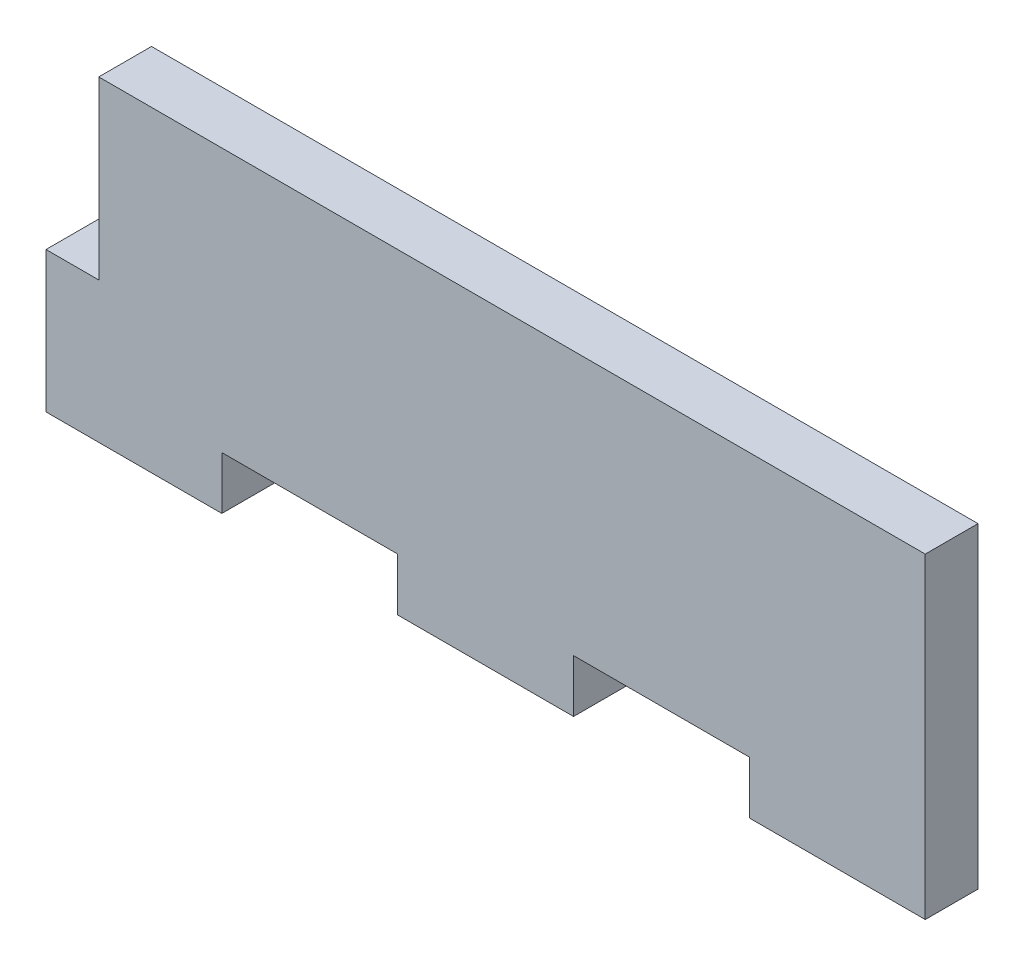
ISO-10303-21;
HEADER;
FILE_DESCRIPTION(('STEP AP214'),'2;1');
FILE_NAME('part.step','',(''),(''),'','','');
FILE_SCHEMA(('AUTOMOTIVE_DESIGN { 1 0 10303 214 1 1 1 1 }'));
ENDSEC;
DATA;
#1=APPLICATION_CONTEXT('core data for automotive mechanical design processes');
#2=APPLICATION_PROTOCOL_DEFINITION('international standard','automotive_design',2000,#1);
#3=PRODUCT_CONTEXT('',#1,'mechanical');
#4=PRODUCT('Part','Part','',(#3));
#5=PRODUCT_RELATED_PRODUCT_CATEGORY('part','',(#4));
#6=PRODUCT_DEFINITION_FORMATION('','',#4);
#7=PRODUCT_DEFINITION_CONTEXT('part definition',#1,'design');
#8=PRODUCT_DEFINITION('design','',#6,#7);
#9=PRODUCT_DEFINITION_SHAPE('','',#8);
#10=(LENGTH_UNIT() NAMED_UNIT(*) SI_UNIT(.MILLI.,.METRE.));
#11=(NAMED_UNIT(*) PLANE_ANGLE_UNIT() SI_UNIT($,.RADIAN.));
#12=(NAMED_UNIT(*) SI_UNIT($,.STERADIAN.) SOLID_ANGLE_UNIT());
#13=UNCERTAINTY_MEASURE_WITH_UNIT(LENGTH_MEASURE(1.E-05),#10,'distance_accuracy_value','');
#14=(GEOMETRIC_REPRESENTATION_CONTEXT(3) GLOBAL_UNCERTAINTY_ASSIGNED_CONTEXT((#13)) GLOBAL_UNIT_ASSIGNED_CONTEXT((#10,
#11,#12)) REPRESENTATION_CONTEXT('',''));
#15=CARTESIAN_POINT('',(0.,0.,0.));
#16=DIRECTION('',(0.,0.,1.));
#17=DIRECTION('',(1.,0.,0.));
#18=AXIS2_PLACEMENT_3D('',#15,#16,#17);
#19=CARTESIAN_POINT('',(0.,-18.,3.));
#20=DIRECTION('',(0.,1.,0.));
#21=DIRECTION('',(0.,0.,1.));
#22=AXIS2_PLACEMENT_3D('',#19,#20,#21);
#23=PLANE('',#22);
#24=DIRECTION('',(1.,0.,0.));
#25=VECTOR('',#24,1.);
#26=CARTESIAN_POINT('',(0.,-18.,3.));
#27=LINE('',#26,#25);
#28=CARTESIAN_POINT('',(20.,-18.,3.));
#29=VERTEX_POINT('',#28);
#30=CARTESIAN_POINT('',(30.,-18.,3.));
#31=VERTEX_POINT('',#30);
#32=EDGE_CURVE('E195',#29,#31,#27,.T.);
#33=ORIENTED_EDGE('',*,*,#32,.F.);
#34=DIRECTION('',(0.,0.,1.));
#35=VECTOR('',#34,1.);
#36=CARTESIAN_POINT('',(20.,-18.,0.));
#37=LINE('',#36,#35);
#38=CARTESIAN_POINT('',(20.,-18.,0.));
#39=VERTEX_POINT('',#38);
#40=EDGE_CURVE('E217',#39,#29,#37,.T.);
#41=ORIENTED_EDGE('',*,*,#40,.F.);
#42=DIRECTION('',(1.,0.,0.));
#43=VECTOR('',#42,1.);
#44=CARTESIAN_POINT('',(0.,-18.,0.));
#45=LINE('',#44,#43);
#46=CARTESIAN_POINT('',(30.,-18.,0.));
#47=VERTEX_POINT('',#46);
#48=EDGE_CURVE('E157',#39,#47,#45,.T.);
#49=ORIENTED_EDGE('',*,*,#48,.T.);
#50=DIRECTION('',(0.,0.,1.));
#51=VECTOR('',#50,1.);
#52=CARTESIAN_POINT('',(30.,-18.,0.));
#53=LINE('',#52,#51);
#54=EDGE_CURVE('E159',#47,#31,#53,.T.);
#55=ORIENTED_EDGE('',*,*,#54,.T.);
#56=EDGE_LOOP('',(#33,#41,#49,#55));
#57=FACE_BOUND('',#56,.T.);
#58=ADVANCED_FACE('F33',(#57),#23,.F.);
#59=CARTESIAN_POINT('',(40.,-18.,3.));
#60=VERTEX_POINT('',#59);
#61=CARTESIAN_POINT('',(50.,-18.,3.));
#62=VERTEX_POINT('',#61);
#63=EDGE_CURVE('E197',#60,#62,#27,.T.);
#64=ORIENTED_EDGE('',*,*,#63,.F.);
#65=DIRECTION('',(0.,0.,1.));
#66=VECTOR('',#65,1.);
#67=CARTESIAN_POINT('',(40.,-18.,0.));
#68=LINE('',#67,#66);
#69=CARTESIAN_POINT('',(40.,-18.,0.));
#70=VERTEX_POINT('',#69);
#71=EDGE_CURVE('E155',#70,#60,#68,.T.);
#72=ORIENTED_EDGE('',*,*,#71,.F.);
#73=CARTESIAN_POINT('',(50.,-18.,0.));
#74=VERTEX_POINT('',#73);
#75=EDGE_CURVE('E154',#70,#74,#45,.T.);
#76=ORIENTED_EDGE('',*,*,#75,.T.);
#77=DIRECTION('',(0.,0.,-1.));
#78=VECTOR('',#77,1.);
#79=CARTESIAN_POINT('',(50.,-18.,3.));
#80=LINE('',#79,#78);
#81=EDGE_CURVE('E41',#62,#74,#80,.T.);
#82=ORIENTED_EDGE('',*,*,#81,.F.);
#83=EDGE_LOOP('',(#64,#72,#76,#82));
#84=FACE_BOUND('',#83,.T.);
#85=ADVANCED_FACE('F266',(#84),#23,.F.);
#86=CARTESIAN_POINT('',(0.,0.,3.));
#87=DIRECTION('',(1.,0.,0.));
#88=DIRECTION('',(0.,1.,0.));
#89=AXIS2_PLACEMENT_3D('',#86,#87,#88);
#90=PLANE('',#89);
#91=DIRECTION('',(0.,-1.,0.));
#92=VECTOR('',#91,1.);
#93=CARTESIAN_POINT('',(0.,0.,3.));
#94=LINE('',#93,#92);
#95=CARTESIAN_POINT('',(0.,-10.,3.));
#96=VERTEX_POINT('',#95);
#97=CARTESIAN_POINT('',(0.,-18.,3.));
#98=VERTEX_POINT('',#97);
#99=EDGE_CURVE('E149',#96,#98,#94,.T.);
#100=ORIENTED_EDGE('',*,*,#99,.F.);
#101=DIRECTION('',(0.,0.,1.));
#102=VECTOR('',#101,1.);
#103=CARTESIAN_POINT('',(0.,-10.,0.));
#104=LINE('',#103,#102);
#105=CARTESIAN_POINT('',(0.,-10.,0.));
#106=VERTEX_POINT('',#105);
#107=EDGE_CURVE('E137',#106,#96,#104,.T.);
#108=ORIENTED_EDGE('',*,*,#107,.F.);
#109=DIRECTION('',(0.,-1.,0.));
#110=VECTOR('',#109,1.);
#111=CARTESIAN_POINT('',(0.,0.,0.));
#112=LINE('',#111,#110);
#113=CARTESIAN_POINT('',(0.,-18.,0.));
#114=VERTEX_POINT('',#113);
#115=EDGE_CURVE('E147',#106,#114,#112,.T.);
#116=ORIENTED_EDGE('',*,*,#115,.T.);
#117=DIRECTION('',(0.,0.,-1.));
#118=VECTOR('',#117,1.);
#119=CARTESIAN_POINT('',(0.,-18.,3.));
#120=LINE('',#119,#118);
#121=EDGE_CURVE('E11',#98,#114,#120,.T.);
#122=ORIENTED_EDGE('',*,*,#121,.F.);
#123=EDGE_LOOP('',(#100,#108,#116,#122));
#124=FACE_BOUND('',#123,.T.);
#125=ADVANCED_FACE('F35',(#124),#90,.F.);
#126=CARTESIAN_POINT('',(10.,-18.,0.));
#127=VERTEX_POINT('',#126);
#128=EDGE_CURVE('E153',#114,#127,#45,.T.);
#129=ORIENTED_EDGE('',*,*,#128,.T.);
#130=DIRECTION('',(0.,0.,1.));
#131=VECTOR('',#130,1.);
#132=CARTESIAN_POINT('',(10.,-18.,0.));
#133=LINE('',#132,#131);
#134=CARTESIAN_POINT('',(10.,-18.,3.));
#135=VERTEX_POINT('',#134);
#136=EDGE_CURVE('E228',#127,#135,#133,.T.);
#137=ORIENTED_EDGE('',*,*,#136,.T.);
#138=EDGE_CURVE('E193',#98,#135,#27,.T.);
#139=ORIENTED_EDGE('',*,*,#138,.F.);
#140=ORIENTED_EDGE('',*,*,#121,.T.);
#141=EDGE_LOOP('',(#129,#137,#139,#140));
#142=FACE_BOUND('',#141,.T.);
#143=ADVANCED_FACE('F268',(#142),#23,.F.);
#144=CARTESIAN_POINT('',(50.,0.,3.));
#145=DIRECTION('',(-1.,0.,0.));
#146=DIRECTION('',(0.,-1.,0.));
#147=AXIS2_PLACEMENT_3D('',#144,#145,#146);
#148=PLANE('',#147);
#149=DIRECTION('',(0.,1.,0.));
#150=VECTOR('',#149,1.);
#151=CARTESIAN_POINT('',(50.,0.,0.));
#152=LINE('',#151,#150);
#153=CARTESIAN_POINT('',(50.,0.,0.));
#154=VERTEX_POINT('',#153);
#155=EDGE_CURVE('E165',#74,#154,#152,.T.);
#156=ORIENTED_EDGE('',*,*,#155,.T.);
#157=DIRECTION('',(0.,0.,-1.));
#158=VECTOR('',#157,1.);
#159=CARTESIAN_POINT('',(50.,0.,3.));
#160=LINE('',#159,#158);
#161=CARTESIAN_POINT('',(50.,0.,3.));
#162=VERTEX_POINT('',#161);
#163=EDGE_CURVE('E170',#162,#154,#160,.T.);
#164=ORIENTED_EDGE('',*,*,#163,.F.);
#165=DIRECTION('',(0.,1.,0.));
#166=VECTOR('',#165,1.);
#167=CARTESIAN_POINT('',(50.,0.,3.));
#168=LINE('',#167,#166);
#169=EDGE_CURVE('E179',#62,#162,#168,.T.);
#170=ORIENTED_EDGE('',*,*,#169,.F.);
#171=ORIENTED_EDGE('',*,*,#81,.T.);
#172=EDGE_LOOP('',(#156,#164,#170,#171));
#173=FACE_BOUND('',#172,.T.);
#174=ADVANCED_FACE('F177',(#173),#148,.F.);
#175=CARTESIAN_POINT('',(0.,0.,3.));
#176=DIRECTION('',(0.,-1.,0.));
#177=DIRECTION('',(0.,0.,-1.));
#178=AXIS2_PLACEMENT_3D('',#175,#176,#177);
#179=PLANE('',#178);
#180=DIRECTION('',(-1.,0.,0.));
#181=VECTOR('',#180,1.);
#182=CARTESIAN_POINT('',(0.,0.,0.));
#183=LINE('',#182,#181);
#184=CARTESIAN_POINT('',(3.,0.,0.));
#185=VERTEX_POINT('',#184);
#186=EDGE_CURVE('E167',#154,#185,#183,.T.);
#187=ORIENTED_EDGE('',*,*,#186,.T.);
#188=DIRECTION('',(0.,0.,1.));
#189=VECTOR('',#188,1.);
#190=CARTESIAN_POINT('',(3.,0.,0.));
#191=LINE('',#190,#189);
#192=CARTESIAN_POINT('',(3.,0.,3.));
#193=VERTEX_POINT('',#192);
#194=EDGE_CURVE('E189',#185,#193,#191,.T.);
#195=ORIENTED_EDGE('',*,*,#194,.T.);
#196=DIRECTION('',(-1.,0.,0.));
#197=VECTOR('',#196,1.);
#198=CARTESIAN_POINT('',(0.,0.,3.));
#199=LINE('',#198,#197);
#200=EDGE_CURVE('E162',#162,#193,#199,.T.);
#201=ORIENTED_EDGE('',*,*,#200,.F.);
#202=ORIENTED_EDGE('',*,*,#163,.T.);
#203=EDGE_LOOP('',(#187,#195,#201,#202));
#204=FACE_BOUND('',#203,.T.);
#205=ADVANCED_FACE('F187',(#204),#179,.F.);
#206=CARTESIAN_POINT('',(0.,0.,3.));
#207=DIRECTION('',(0.,0.,1.));
#208=DIRECTION('',(1.,0.,0.));
#209=AXIS2_PLACEMENT_3D('',#206,#207,#208);
#210=PLANE('',#209);
#211=DIRECTION('',(0.,1.,0.));
#212=VECTOR('',#211,1.);
#213=CARTESIAN_POINT('',(3.,0.,3.));
#214=LINE('',#213,#212);
#215=CARTESIAN_POINT('',(3.,-10.,3.));
#216=VERTEX_POINT('',#215);
#217=EDGE_CURVE('E142',#216,#193,#214,.T.);
#218=ORIENTED_EDGE('',*,*,#217,.F.);
#219=DIRECTION('',(1.,0.,0.));
#220=VECTOR('',#219,1.);
#221=CARTESIAN_POINT('',(0.,-10.,3.));
#222=LINE('',#221,#220);
#223=EDGE_CURVE('E250',#96,#216,#222,.T.);
#224=ORIENTED_EDGE('',*,*,#223,.F.);
#225=ORIENTED_EDGE('',*,*,#99,.T.);
#226=ORIENTED_EDGE('',*,*,#138,.T.);
#227=DIRECTION('',(0.,-1.,0.));
#228=VECTOR('',#227,1.);
#229=CARTESIAN_POINT('',(10.,-18.,3.));
#230=LINE('',#229,#228);
#231=CARTESIAN_POINT('',(10.,-15.,3.));
#232=VERTEX_POINT('',#231);
#233=EDGE_CURVE('E232',#232,#135,#230,.T.);
#234=ORIENTED_EDGE('',*,*,#233,.F.);
#235=DIRECTION('',(-1.,0.,0.));
#236=VECTOR('',#235,1.);
#237=CARTESIAN_POINT('',(20.,-15.,3.));
#238=LINE('',#237,#236);
#239=CARTESIAN_POINT('',(20.,-15.,3.));
#240=VERTEX_POINT('',#239);
#241=EDGE_CURVE('E235',#240,#232,#238,.T.);
#242=ORIENTED_EDGE('',*,*,#241,.F.);
#243=DIRECTION('',(0.,1.,0.));
#244=VECTOR('',#243,1.);
#245=CARTESIAN_POINT('',(20.,-18.,3.));
#246=LINE('',#245,#244);
#247=EDGE_CURVE('E238',#29,#240,#246,.T.);
#248=ORIENTED_EDGE('',*,*,#247,.F.);
#249=ORIENTED_EDGE('',*,*,#32,.T.);
#250=DIRECTION('',(0.,-1.,0.));
#251=VECTOR('',#250,1.);
#252=CARTESIAN_POINT('',(30.,-18.,3.));
#253=LINE('',#252,#251);
#254=CARTESIAN_POINT('',(30.,-15.,3.));
#255=VERTEX_POINT('',#254);
#256=EDGE_CURVE('E207',#255,#31,#253,.T.);
#257=ORIENTED_EDGE('',*,*,#256,.F.);
#258=DIRECTION('',(-1.,0.,0.));
#259=VECTOR('',#258,1.);
#260=CARTESIAN_POINT('',(40.,-15.,3.));
#261=LINE('',#260,#259);
#262=CARTESIAN_POINT('',(40.,-15.,3.));
#263=VERTEX_POINT('',#262);
#264=EDGE_CURVE('E211',#263,#255,#261,.T.);
#265=ORIENTED_EDGE('',*,*,#264,.F.);
#266=DIRECTION('',(0.,1.,0.));
#267=VECTOR('',#266,1.);
#268=CARTESIAN_POINT('',(40.,-18.,3.));
#269=LINE('',#268,#267);
#270=EDGE_CURVE('E214',#60,#263,#269,.T.);
#271=ORIENTED_EDGE('',*,*,#270,.F.);
#272=ORIENTED_EDGE('',*,*,#63,.T.);
#273=ORIENTED_EDGE('',*,*,#169,.T.);
#274=ORIENTED_EDGE('',*,*,#200,.T.);
#275=EDGE_LOOP('',(#218,#224,#225,#226,#234,#242,#248,#249,#257,#265,#271,#272,#273,#274));
#276=FACE_BOUND('',#275,.T.);
#277=ADVANCED_FACE('F252',(#276),#210,.T.);
#278=CARTESIAN_POINT('',(0.,0.,0.));
#279=DIRECTION('',(0.,0.,1.));
#280=DIRECTION('',(1.,0.,0.));
#281=AXIS2_PLACEMENT_3D('',#278,#279,#280);
#282=PLANE('',#281);
#283=DIRECTION('',(1.,0.,0.));
#284=VECTOR('',#283,1.);
#285=CARTESIAN_POINT('',(0.,-10.,0.));
#286=LINE('',#285,#284);
#287=CARTESIAN_POINT('',(3.,-10.,0.));
#288=VERTEX_POINT('',#287);
#289=EDGE_CURVE('E133',#106,#288,#286,.T.);
#290=ORIENTED_EDGE('',*,*,#289,.T.);
#291=DIRECTION('',(0.,1.,0.));
#292=VECTOR('',#291,1.);
#293=CARTESIAN_POINT('',(3.,0.,0.));
#294=LINE('',#293,#292);
#295=EDGE_CURVE('E48',#288,#185,#294,.T.);
#296=ORIENTED_EDGE('',*,*,#295,.T.);
#297=ORIENTED_EDGE('',*,*,#186,.F.);
#298=ORIENTED_EDGE('',*,*,#155,.F.);
#299=ORIENTED_EDGE('',*,*,#75,.F.);
#300=DIRECTION('',(0.,1.,0.));
#301=VECTOR('',#300,1.);
#302=CARTESIAN_POINT('',(40.,-18.,0.));
#303=LINE('',#302,#301);
#304=CARTESIAN_POINT('',(40.,-15.,0.));
#305=VERTEX_POINT('',#304);
#306=EDGE_CURVE('E210',#70,#305,#303,.T.);
#307=ORIENTED_EDGE('',*,*,#306,.T.);
#308=DIRECTION('',(-1.,0.,0.));
#309=VECTOR('',#308,1.);
#310=CARTESIAN_POINT('',(40.,-15.,0.));
#311=LINE('',#310,#309);
#312=CARTESIAN_POINT('',(30.,-15.,0.));
#313=VERTEX_POINT('',#312);
#314=EDGE_CURVE('E220',#305,#313,#311,.T.);
#315=ORIENTED_EDGE('',*,*,#314,.T.);
#316=DIRECTION('',(0.,-1.,0.));
#317=VECTOR('',#316,1.);
#318=CARTESIAN_POINT('',(30.,-18.,0.));
#319=LINE('',#318,#317);
#320=EDGE_CURVE('E203',#313,#47,#319,.T.);
#321=ORIENTED_EDGE('',*,*,#320,.T.);
#322=ORIENTED_EDGE('',*,*,#48,.F.);
#323=DIRECTION('',(0.,1.,0.));
#324=VECTOR('',#323,1.);
#325=CARTESIAN_POINT('',(20.,-18.,0.));
#326=LINE('',#325,#324);
#327=CARTESIAN_POINT('',(20.,-15.,0.));
#328=VERTEX_POINT('',#327);
#329=EDGE_CURVE('E234',#39,#328,#326,.T.);
#330=ORIENTED_EDGE('',*,*,#329,.T.);
#331=DIRECTION('',(-1.,0.,0.));
#332=VECTOR('',#331,1.);
#333=CARTESIAN_POINT('',(20.,-15.,0.));
#334=LINE('',#333,#332);
#335=CARTESIAN_POINT('',(10.,-15.,0.));
#336=VERTEX_POINT('',#335);
#337=EDGE_CURVE('E242',#328,#336,#334,.T.);
#338=ORIENTED_EDGE('',*,*,#337,.T.);
#339=DIRECTION('',(0.,-1.,0.));
#340=VECTOR('',#339,1.);
#341=CARTESIAN_POINT('',(10.,-18.,0.));
#342=LINE('',#341,#340);
#343=EDGE_CURVE('E56',#336,#127,#342,.T.);
#344=ORIENTED_EDGE('',*,*,#343,.T.);
#345=ORIENTED_EDGE('',*,*,#128,.F.);
#346=ORIENTED_EDGE('',*,*,#115,.F.);
#347=EDGE_LOOP('',(#290,#296,#297,#298,#299,#307,#315,#321,#322,#330,#338,#344,#345,#346));
#348=FACE_BOUND('',#347,.T.);
#349=ADVANCED_FACE('F151',(#348),#282,.F.);
#350=CARTESIAN_POINT('',(40.,-18.,0.));
#351=DIRECTION('',(1.,0.,0.));
#352=DIRECTION('',(0.,0.,-1.));
#353=AXIS2_PLACEMENT_3D('',#350,#351,#352);
#354=PLANE('',#353);
#355=ORIENTED_EDGE('',*,*,#270,.T.);
#356=DIRECTION('',(0.,0.,1.));
#357=VECTOR('',#356,1.);
#358=CARTESIAN_POINT('',(40.,-15.,0.));
#359=LINE('',#358,#357);
#360=EDGE_CURVE('E200',#305,#263,#359,.T.);
#361=ORIENTED_EDGE('',*,*,#360,.F.);
#362=ORIENTED_EDGE('',*,*,#306,.F.);
#363=ORIENTED_EDGE('',*,*,#71,.T.);
#364=EDGE_LOOP('',(#355,#361,#362,#363));
#365=FACE_BOUND('',#364,.T.);
#366=ADVANCED_FACE('F295',(#365),#354,.F.);
#367=CARTESIAN_POINT('',(30.,-18.,0.));
#368=DIRECTION('',(-1.,0.,0.));
#369=DIRECTION('',(0.,0.,1.));
#370=AXIS2_PLACEMENT_3D('',#367,#368,#369);
#371=PLANE('',#370);
#372=ORIENTED_EDGE('',*,*,#256,.T.);
#373=ORIENTED_EDGE('',*,*,#54,.F.);
#374=ORIENTED_EDGE('',*,*,#320,.F.);
#375=DIRECTION('',(0.,0.,1.));
#376=VECTOR('',#375,1.);
#377=CARTESIAN_POINT('',(30.,-15.,0.));
#378=LINE('',#377,#376);
#379=EDGE_CURVE('E202',#313,#255,#378,.T.);
#380=ORIENTED_EDGE('',*,*,#379,.T.);
#381=EDGE_LOOP('',(#372,#373,#374,#380));
#382=FACE_BOUND('',#381,.T.);
#383=ADVANCED_FACE('F301',(#382),#371,.F.);
#384=CARTESIAN_POINT('',(40.,-15.,0.));
#385=DIRECTION('',(0.,1.,0.));
#386=DIRECTION('',(0.,0.,1.));
#387=AXIS2_PLACEMENT_3D('',#384,#385,#386);
#388=PLANE('',#387);
#389=ORIENTED_EDGE('',*,*,#264,.T.);
#390=ORIENTED_EDGE('',*,*,#379,.F.);
#391=ORIENTED_EDGE('',*,*,#314,.F.);
#392=ORIENTED_EDGE('',*,*,#360,.T.);
#393=EDGE_LOOP('',(#389,#390,#391,#392));
#394=FACE_BOUND('',#393,.T.);
#395=ADVANCED_FACE('F299',(#394),#388,.F.);
#396=CARTESIAN_POINT('',(20.,-18.,0.));
#397=DIRECTION('',(1.,0.,0.));
#398=DIRECTION('',(0.,0.,-1.));
#399=AXIS2_PLACEMENT_3D('',#396,#397,#398);
#400=PLANE('',#399);
#401=ORIENTED_EDGE('',*,*,#247,.T.);
#402=DIRECTION('',(0.,0.,1.));
#403=VECTOR('',#402,1.);
#404=CARTESIAN_POINT('',(20.,-15.,0.));
#405=LINE('',#404,#403);
#406=EDGE_CURVE('E224',#328,#240,#405,.T.);
#407=ORIENTED_EDGE('',*,*,#406,.F.);
#408=ORIENTED_EDGE('',*,*,#329,.F.);
#409=ORIENTED_EDGE('',*,*,#40,.T.);
#410=EDGE_LOOP('',(#401,#407,#408,#409));
#411=FACE_BOUND('',#410,.T.);
#412=ADVANCED_FACE('F286',(#411),#400,.F.);
#413=CARTESIAN_POINT('',(10.,-18.,0.));
#414=DIRECTION('',(-1.,0.,0.));
#415=DIRECTION('',(0.,0.,1.));
#416=AXIS2_PLACEMENT_3D('',#413,#414,#415);
#417=PLANE('',#416);
#418=ORIENTED_EDGE('',*,*,#233,.T.);
#419=ORIENTED_EDGE('',*,*,#136,.F.);
#420=ORIENTED_EDGE('',*,*,#343,.F.);
#421=DIRECTION('',(0.,0.,1.));
#422=VECTOR('',#421,1.);
#423=CARTESIAN_POINT('',(10.,-15.,0.));
#424=LINE('',#423,#422);
#425=EDGE_CURVE('E226',#336,#232,#424,.T.);
#426=ORIENTED_EDGE('',*,*,#425,.T.);
#427=EDGE_LOOP('',(#418,#419,#420,#426));
#428=FACE_BOUND('',#427,.T.);
#429=ADVANCED_FACE('F262',(#428),#417,.F.);
#430=CARTESIAN_POINT('',(20.,-15.,0.));
#431=DIRECTION('',(0.,1.,0.));
#432=DIRECTION('',(0.,0.,1.));
#433=AXIS2_PLACEMENT_3D('',#430,#431,#432);
#434=PLANE('',#433);
#435=ORIENTED_EDGE('',*,*,#241,.T.);
#436=ORIENTED_EDGE('',*,*,#425,.F.);
#437=ORIENTED_EDGE('',*,*,#337,.F.);
#438=ORIENTED_EDGE('',*,*,#406,.T.);
#439=EDGE_LOOP('',(#435,#436,#437,#438));
#440=FACE_BOUND('',#439,.T.);
#441=ADVANCED_FACE('F255',(#440),#434,.F.);
#442=CARTESIAN_POINT('',(3.,0.,0.));
#443=DIRECTION('',(1.,0.,0.));
#444=DIRECTION('',(0.,1.,0.));
#445=AXIS2_PLACEMENT_3D('',#442,#443,#444);
#446=PLANE('',#445);
#447=ORIENTED_EDGE('',*,*,#217,.T.);
#448=ORIENTED_EDGE('',*,*,#194,.F.);
#449=ORIENTED_EDGE('',*,*,#295,.F.);
#450=DIRECTION('',(0.,0.,1.));
#451=VECTOR('',#450,1.);
#452=CARTESIAN_POINT('',(3.,-10.,0.));
#453=LINE('',#452,#451);
#454=EDGE_CURVE('E139',#288,#216,#453,.T.);
#455=ORIENTED_EDGE('',*,*,#454,.T.);
#456=EDGE_LOOP('',(#447,#448,#449,#455));
#457=FACE_BOUND('',#456,.T.);
#458=ADVANCED_FACE('F253',(#457),#446,.F.);
#459=CARTESIAN_POINT('',(0.,-10.,0.));
#460=DIRECTION('',(0.,-1.,0.));
#461=DIRECTION('',(0.,0.,-1.));
#462=AXIS2_PLACEMENT_3D('',#459,#460,#461);
#463=PLANE('',#462);
#464=ORIENTED_EDGE('',*,*,#223,.T.);
#465=ORIENTED_EDGE('',*,*,#454,.F.);
#466=ORIENTED_EDGE('',*,*,#289,.F.);
#467=ORIENTED_EDGE('',*,*,#107,.T.);
#468=EDGE_LOOP('',(#464,#465,#466,#467));
#469=FACE_BOUND('',#468,.T.);
#470=ADVANCED_FACE('F136',(#469),#463,.F.);
#471=CLOSED_SHELL('',(#58,#85,#125,#143,#174,#205,#277,#349,#366,#383,#395,#412,#429,#441,#458,#470));
#472=MANIFOLD_SOLID_BREP('B2',#471);
#473=ADVANCED_BREP_SHAPE_REPRESENTATION('',(#18,#472),#14);
#474=SHAPE_DEFINITION_REPRESENTATION(#9,#473);
ENDSEC;
END-ISO-10303-21;
